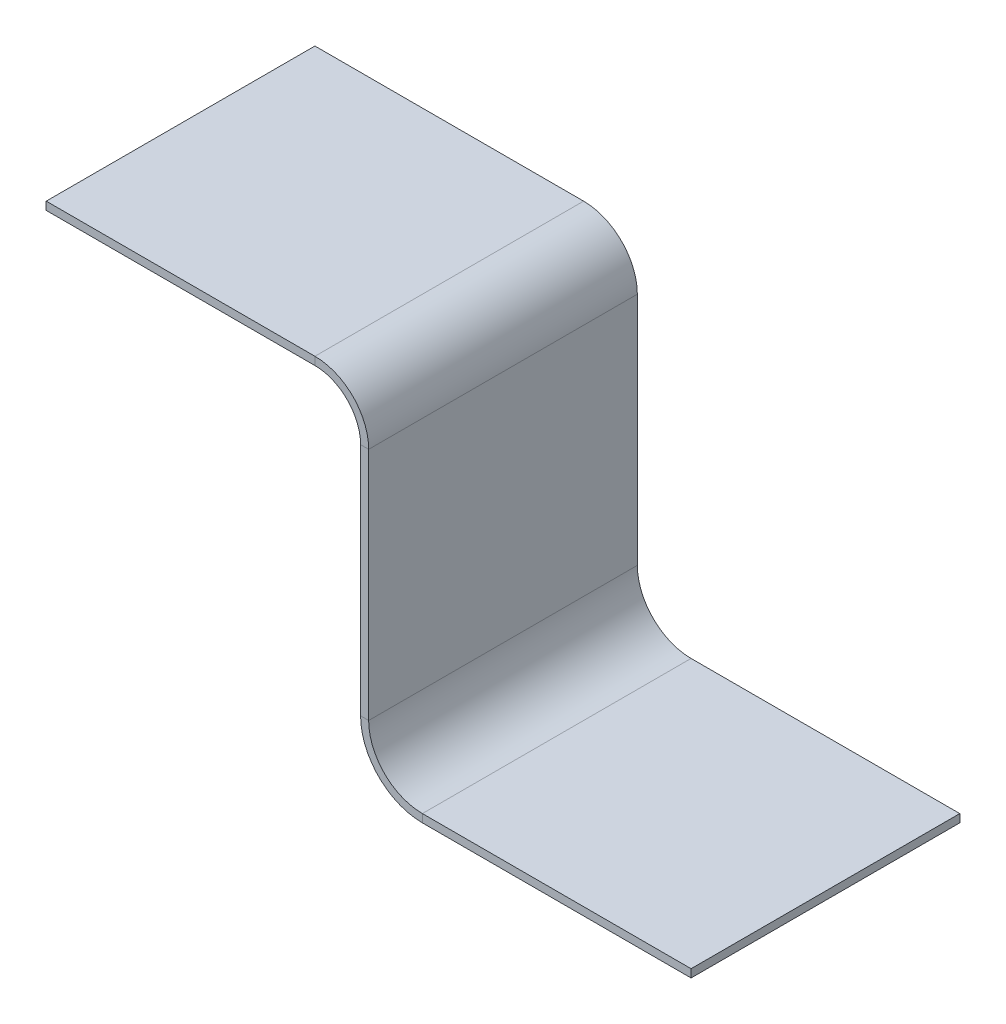
ISO-10303-21;
HEADER;
FILE_DESCRIPTION(('STEP AP214'),'2;1');
FILE_NAME('part.step','',(''),(''),'','','');
FILE_SCHEMA(('AUTOMOTIVE_DESIGN { 1 0 10303 214 1 1 1 1 }'));
ENDSEC;
DATA;
#1=APPLICATION_CONTEXT('core data for automotive mechanical design processes');
#2=APPLICATION_PROTOCOL_DEFINITION('international standard','automotive_design',2000,#1);
#3=PRODUCT_CONTEXT('',#1,'mechanical');
#4=PRODUCT('Part','Part','',(#3));
#5=PRODUCT_RELATED_PRODUCT_CATEGORY('part','',(#4));
#6=PRODUCT_DEFINITION_FORMATION('','',#4);
#7=PRODUCT_DEFINITION_CONTEXT('part definition',#1,'design');
#8=PRODUCT_DEFINITION('design','',#6,#7);
#9=PRODUCT_DEFINITION_SHAPE('','',#8);
#10=(LENGTH_UNIT() NAMED_UNIT(*) SI_UNIT(.MILLI.,.METRE.));
#11=(NAMED_UNIT(*) PLANE_ANGLE_UNIT() SI_UNIT($,.RADIAN.));
#12=(NAMED_UNIT(*) SI_UNIT($,.STERADIAN.) SOLID_ANGLE_UNIT());
#13=UNCERTAINTY_MEASURE_WITH_UNIT(LENGTH_MEASURE(1.E-05),#10,'distance_accuracy_value','');
#14=(GEOMETRIC_REPRESENTATION_CONTEXT(3) GLOBAL_UNCERTAINTY_ASSIGNED_CONTEXT((#13)) GLOBAL_UNIT_ASSIGNED_CONTEXT((#10,
#11,#12)) REPRESENTATION_CONTEXT('',''));
#15=CARTESIAN_POINT('',(0.,0.,0.));
#16=DIRECTION('',(0.,0.,1.));
#17=DIRECTION('',(1.,0.,0.));
#18=AXIS2_PLACEMENT_3D('',#15,#16,#17);
#19=CARTESIAN_POINT('',(0.,5.37,5.));
#20=DIRECTION('',(0.,0.,1.));
#21=DIRECTION('',(1.,0.,0.));
#22=AXIS2_PLACEMENT_3D('',#19,#20,#21);
#23=PLANE('',#22);
#24=DIRECTION('',(-1.,0.,0.));
#25=VECTOR('',#24,1.);
#26=CARTESIAN_POINT('',(0.,5.37,5.));
#27=LINE('',#26,#25);
#28=CARTESIAN_POINT('',(0.,5.37,5.));
#29=VERTEX_POINT('',#28);
#30=CARTESIAN_POINT('',(-0.15,5.37,5.));
#31=VERTEX_POINT('',#30);
#32=EDGE_CURVE('E11',#29,#31,#27,.T.);
#33=ORIENTED_EDGE('',*,*,#32,.F.);
#34=CARTESIAN_POINT('',(-1.,5.37,5.));
#35=DIRECTION('',(0.,0.,-1.));
#36=DIRECTION('',(-1.,0.,0.));
#37=AXIS2_PLACEMENT_3D('',#34,#35,#36);
#38=CIRCLE('',#37,1.);
#39=CARTESIAN_POINT('',(-1.,6.37,5.));
#40=VERTEX_POINT('',#39);
#41=EDGE_CURVE('E247',#40,#29,#38,.T.);
#42=ORIENTED_EDGE('',*,*,#41,.F.);
#43=DIRECTION('',(0.,1.,0.));
#44=VECTOR('',#43,1.);
#45=CARTESIAN_POINT('',(-1.,6.22,5.));
#46=LINE('',#45,#44);
#47=CARTESIAN_POINT('',(-1.,6.22,5.));
#48=VERTEX_POINT('',#47);
#49=EDGE_CURVE('E45',#48,#40,#46,.T.);
#50=ORIENTED_EDGE('',*,*,#49,.F.);
#51=CARTESIAN_POINT('',(-1.,5.37,5.));
#52=DIRECTION('',(0.,0.,1.));
#53=DIRECTION('',(1.,0.,0.));
#54=AXIS2_PLACEMENT_3D('',#51,#52,#53);
#55=CIRCLE('',#54,0.850000000000001);
#56=EDGE_CURVE('E146',#48,#31,#55,.F.);
#57=ORIENTED_EDGE('',*,*,#56,.T.);
#58=EDGE_LOOP('',(#33,#42,#50,#57));
#59=FACE_BOUND('',#58,.T.);
#60=ADVANCED_FACE('F37',(#59),#23,.T.);
#61=CARTESIAN_POINT('',(-1.,6.22,5.));
#62=DIRECTION('',(0.,0.,1.));
#63=DIRECTION('',(1.,0.,0.));
#64=AXIS2_PLACEMENT_3D('',#61,#62,#63);
#65=PLANE('',#64);
#66=DIRECTION('',(0.,-1.,0.));
#67=VECTOR('',#66,1.);
#68=CARTESIAN_POINT('',(0.,5.37,5.));
#69=LINE('',#68,#67);
#70=CARTESIAN_POINT('',(0.,1.00000000000001,5.));
#71=VERTEX_POINT('',#70);
#72=EDGE_CURVE('E140',#29,#71,#69,.T.);
#73=ORIENTED_EDGE('',*,*,#72,.F.);
#74=ORIENTED_EDGE('',*,*,#32,.T.);
#75=DIRECTION('',(0.,-1.,0.));
#76=VECTOR('',#75,1.);
#77=CARTESIAN_POINT('',(-0.15,5.37,5.));
#78=LINE('',#77,#76);
#79=CARTESIAN_POINT('',(-0.149999999999999,1.00000000000001,5.));
#80=VERTEX_POINT('',#79);
#81=EDGE_CURVE('E137',#31,#80,#78,.T.);
#82=ORIENTED_EDGE('',*,*,#81,.T.);
#83=DIRECTION('',(1.,0.,0.));
#84=VECTOR('',#83,1.);
#85=CARTESIAN_POINT('',(-0.149999999999999,1.00000000000001,5.));
#86=LINE('',#85,#84);
#87=EDGE_CURVE('E228',#80,#71,#86,.T.);
#88=ORIENTED_EDGE('',*,*,#87,.T.);
#89=EDGE_LOOP('',(#73,#74,#82,#88));
#90=FACE_BOUND('',#89,.T.);
#91=ADVANCED_FACE('F135',(#90),#65,.T.);
#92=CARTESIAN_POINT('',(-1.,6.37,0.));
#93=DIRECTION('',(0.,0.,-1.));
#94=DIRECTION('',(-1.,0.,0.));
#95=AXIS2_PLACEMENT_3D('',#92,#93,#94);
#96=PLANE('',#95);
#97=DIRECTION('',(0.,-1.,0.));
#98=VECTOR('',#97,1.);
#99=CARTESIAN_POINT('',(-1.,6.37,0.));
#100=LINE('',#99,#98);
#101=CARTESIAN_POINT('',(-1.,6.37,0.));
#102=VERTEX_POINT('',#101);
#103=CARTESIAN_POINT('',(-1.,6.22,0.));
#104=VERTEX_POINT('',#103);
#105=EDGE_CURVE('E233',#102,#104,#100,.T.);
#106=ORIENTED_EDGE('',*,*,#105,.F.);
#107=CARTESIAN_POINT('',(-1.,5.37,0.));
#108=DIRECTION('',(0.,0.,-1.));
#109=DIRECTION('',(-1.,0.,0.));
#110=AXIS2_PLACEMENT_3D('',#107,#108,#109);
#111=CIRCLE('',#110,1.);
#112=CARTESIAN_POINT('',(0.,5.37,0.));
#113=VERTEX_POINT('',#112);
#114=EDGE_CURVE('E185',#102,#113,#111,.T.);
#115=ORIENTED_EDGE('',*,*,#114,.T.);
#116=DIRECTION('',(1.,0.,0.));
#117=VECTOR('',#116,1.);
#118=CARTESIAN_POINT('',(-0.15,5.37,0.));
#119=LINE('',#118,#117);
#120=CARTESIAN_POINT('',(-0.15,5.37,0.));
#121=VERTEX_POINT('',#120);
#122=EDGE_CURVE('E231',#121,#113,#119,.T.);
#123=ORIENTED_EDGE('',*,*,#122,.F.);
#124=CARTESIAN_POINT('',(-1.,5.37,0.));
#125=DIRECTION('',(0.,0.,1.));
#126=DIRECTION('',(1.,0.,0.));
#127=AXIS2_PLACEMENT_3D('',#124,#125,#126);
#128=CIRCLE('',#127,0.850000000000001);
#129=EDGE_CURVE('E158',#104,#121,#128,.F.);
#130=ORIENTED_EDGE('',*,*,#129,.F.);
#131=EDGE_LOOP('',(#106,#115,#123,#130));
#132=FACE_BOUND('',#131,.T.);
#133=ADVANCED_FACE('F285',(#132),#96,.T.);
#134=CARTESIAN_POINT('',(-0.15,5.37,0.));
#135=DIRECTION('',(0.,0.,-1.));
#136=DIRECTION('',(-1.,0.,0.));
#137=AXIS2_PLACEMENT_3D('',#134,#135,#136);
#138=PLANE('',#137);
#139=DIRECTION('',(1.,0.,0.));
#140=VECTOR('',#139,1.);
#141=CARTESIAN_POINT('',(-6.,6.37,0.));
#142=LINE('',#141,#140);
#143=CARTESIAN_POINT('',(-6.,6.37,0.));
#144=VERTEX_POINT('',#143);
#145=EDGE_CURVE('E188',#144,#102,#142,.T.);
#146=ORIENTED_EDGE('',*,*,#145,.T.);
#147=ORIENTED_EDGE('',*,*,#105,.T.);
#148=DIRECTION('',(1.,0.,0.));
#149=VECTOR('',#148,1.);
#150=CARTESIAN_POINT('',(-6.,6.22,0.));
#151=LINE('',#150,#149);
#152=CARTESIAN_POINT('',(-6.,6.22,0.));
#153=VERTEX_POINT('',#152);
#154=EDGE_CURVE('E194',#153,#104,#151,.T.);
#155=ORIENTED_EDGE('',*,*,#154,.F.);
#156=DIRECTION('',(0.,1.,0.));
#157=VECTOR('',#156,1.);
#158=CARTESIAN_POINT('',(-6.,6.22,0.));
#159=LINE('',#158,#157);
#160=EDGE_CURVE('E191',#153,#144,#159,.T.);
#161=ORIENTED_EDGE('',*,*,#160,.T.);
#162=EDGE_LOOP('',(#146,#147,#155,#161));
#163=FACE_BOUND('',#162,.T.);
#164=ADVANCED_FACE('F288',(#163),#138,.T.);
#165=CARTESIAN_POINT('',(1.00000000000001,0.,5.));
#166=DIRECTION('',(0.,0.,1.));
#167=DIRECTION('',(1.,0.,0.));
#168=AXIS2_PLACEMENT_3D('',#165,#166,#167);
#169=PLANE('',#168);
#170=DIRECTION('',(0.,-1.,0.));
#171=VECTOR('',#170,1.);
#172=CARTESIAN_POINT('',(1.00000000000001,0.,5.));
#173=LINE('',#172,#171);
#174=CARTESIAN_POINT('',(1.00000000000001,0.,5.));
#175=VERTEX_POINT('',#174);
#176=CARTESIAN_POINT('',(1.00000000000001,-0.15,5.));
#177=VERTEX_POINT('',#176);
#178=EDGE_CURVE('E53',#175,#177,#173,.T.);
#179=ORIENTED_EDGE('',*,*,#178,.F.);
#180=CARTESIAN_POINT('',(1.,1.,5.));
#181=DIRECTION('',(0.,0.,1.));
#182=DIRECTION('',(1.,0.,0.));
#183=AXIS2_PLACEMENT_3D('',#180,#181,#182);
#184=CIRCLE('',#183,1.);
#185=EDGE_CURVE('E257',#71,#175,#184,.T.);
#186=ORIENTED_EDGE('',*,*,#185,.F.);
#187=ORIENTED_EDGE('',*,*,#87,.F.);
#188=CARTESIAN_POINT('',(1.,1.,5.));
#189=DIRECTION('',(0.,0.,1.));
#190=DIRECTION('',(1.,0.,0.));
#191=AXIS2_PLACEMENT_3D('',#188,#189,#190);
#192=CIRCLE('',#191,1.15);
#193=EDGE_CURVE('E166',#80,#177,#192,.T.);
#194=ORIENTED_EDGE('',*,*,#193,.T.);
#195=EDGE_LOOP('',(#179,#186,#187,#194));
#196=FACE_BOUND('',#195,.T.);
#197=ADVANCED_FACE('F280',(#196),#169,.T.);
#198=CARTESIAN_POINT('',(-0.149999999999999,1.00000000000001,5.));
#199=DIRECTION('',(0.,0.,1.));
#200=DIRECTION('',(1.,0.,0.));
#201=AXIS2_PLACEMENT_3D('',#198,#199,#200);
#202=PLANE('',#201);
#203=DIRECTION('',(1.,0.,0.));
#204=VECTOR('',#203,1.);
#205=CARTESIAN_POINT('',(1.00000000000001,0.,5.));
#206=LINE('',#205,#204);
#207=CARTESIAN_POINT('',(6.,0.,5.));
#208=VERTEX_POINT('',#207);
#209=EDGE_CURVE('E260',#175,#208,#206,.T.);
#210=ORIENTED_EDGE('',*,*,#209,.F.);
#211=ORIENTED_EDGE('',*,*,#178,.T.);
#212=DIRECTION('',(1.,0.,0.));
#213=VECTOR('',#212,1.);
#214=CARTESIAN_POINT('',(1.00000000000001,-0.15,5.));
#215=LINE('',#214,#213);
#216=CARTESIAN_POINT('',(6.,-0.15,5.));
#217=VERTEX_POINT('',#216);
#218=EDGE_CURVE('E107',#177,#217,#215,.T.);
#219=ORIENTED_EDGE('',*,*,#218,.T.);
#220=DIRECTION('',(0.,-1.,0.));
#221=VECTOR('',#220,1.);
#222=CARTESIAN_POINT('',(6.,0.,5.));
#223=LINE('',#222,#221);
#224=EDGE_CURVE('E263',#208,#217,#223,.T.);
#225=ORIENTED_EDGE('',*,*,#224,.F.);
#226=EDGE_LOOP('',(#210,#211,#219,#225));
#227=FACE_BOUND('',#226,.T.);
#228=ADVANCED_FACE('F269',(#227),#202,.T.);
#229=CARTESIAN_POINT('',(0.,1.00000000000001,0.));
#230=DIRECTION('',(0.,0.,-1.));
#231=DIRECTION('',(-1.,0.,0.));
#232=AXIS2_PLACEMENT_3D('',#229,#230,#231);
#233=PLANE('',#232);
#234=DIRECTION('',(-1.,0.,0.));
#235=VECTOR('',#234,1.);
#236=CARTESIAN_POINT('',(0.,1.00000000000001,0.));
#237=LINE('',#236,#235);
#238=CARTESIAN_POINT('',(0.,1.00000000000001,0.));
#239=VERTEX_POINT('',#238);
#240=CARTESIAN_POINT('',(-0.149999999999999,1.00000000000001,0.));
#241=VERTEX_POINT('',#240);
#242=EDGE_CURVE('E94',#239,#241,#237,.T.);
#243=ORIENTED_EDGE('',*,*,#242,.F.);
#244=CARTESIAN_POINT('',(1.,1.,0.));
#245=DIRECTION('',(0.,0.,1.));
#246=DIRECTION('',(1.,0.,0.));
#247=AXIS2_PLACEMENT_3D('',#244,#245,#246);
#248=CIRCLE('',#247,1.);
#249=CARTESIAN_POINT('',(1.00000000000001,0.,0.));
#250=VERTEX_POINT('',#249);
#251=EDGE_CURVE('E181',#239,#250,#248,.T.);
#252=ORIENTED_EDGE('',*,*,#251,.T.);
#253=DIRECTION('',(0.,1.,0.));
#254=VECTOR('',#253,1.);
#255=CARTESIAN_POINT('',(1.00000000000001,-0.15,0.));
#256=LINE('',#255,#254);
#257=CARTESIAN_POINT('',(1.00000000000001,-0.15,0.));
#258=VERTEX_POINT('',#257);
#259=EDGE_CURVE('E101',#258,#250,#256,.T.);
#260=ORIENTED_EDGE('',*,*,#259,.F.);
#261=CARTESIAN_POINT('',(1.,1.,0.));
#262=DIRECTION('',(0.,0.,1.));
#263=DIRECTION('',(1.,0.,0.));
#264=AXIS2_PLACEMENT_3D('',#261,#262,#263);
#265=CIRCLE('',#264,1.15);
#266=EDGE_CURVE('E200',#241,#258,#265,.T.);
#267=ORIENTED_EDGE('',*,*,#266,.F.);
#268=EDGE_LOOP('',(#243,#252,#260,#267));
#269=FACE_BOUND('',#268,.T.);
#270=ADVANCED_FACE('F317',(#269),#233,.T.);
#271=CARTESIAN_POINT('',(1.00000000000001,-0.15,0.));
#272=DIRECTION('',(0.,0.,-1.));
#273=DIRECTION('',(-1.,0.,0.));
#274=AXIS2_PLACEMENT_3D('',#271,#272,#273);
#275=PLANE('',#274);
#276=DIRECTION('',(0.,-1.,0.));
#277=VECTOR('',#276,1.);
#278=CARTESIAN_POINT('',(0.,5.37,0.));
#279=LINE('',#278,#277);
#280=EDGE_CURVE('E183',#113,#239,#279,.T.);
#281=ORIENTED_EDGE('',*,*,#280,.T.);
#282=ORIENTED_EDGE('',*,*,#242,.T.);
#283=DIRECTION('',(0.,-1.,0.));
#284=VECTOR('',#283,1.);
#285=CARTESIAN_POINT('',(-0.15,5.37,0.));
#286=LINE('',#285,#284);
#287=EDGE_CURVE('E198',#121,#241,#286,.T.);
#288=ORIENTED_EDGE('',*,*,#287,.F.);
#289=ORIENTED_EDGE('',*,*,#122,.T.);
#290=EDGE_LOOP('',(#281,#282,#288,#289));
#291=FACE_BOUND('',#290,.T.);
#292=ADVANCED_FACE('F320',(#291),#275,.T.);
#293=CARTESIAN_POINT('',(1.00000000000001,-0.15,5.));
#294=DIRECTION('',(0.,1.,0.));
#295=DIRECTION('',(0.,0.,1.));
#296=AXIS2_PLACEMENT_3D('',#293,#294,#295);
#297=PLANE('',#296);
#298=DIRECTION('',(1.,0.,0.));
#299=VECTOR('',#298,1.);
#300=CARTESIAN_POINT('',(1.00000000000001,-0.15,0.));
#301=LINE('',#300,#299);
#302=CARTESIAN_POINT('',(6.,-0.15,0.));
#303=VERTEX_POINT('',#302);
#304=EDGE_CURVE('E172',#258,#303,#301,.T.);
#305=ORIENTED_EDGE('',*,*,#304,.T.);
#306=DIRECTION('',(0.,0.,-1.));
#307=VECTOR('',#306,1.);
#308=CARTESIAN_POINT('',(6.,-0.15,5.));
#309=LINE('',#308,#307);
#310=EDGE_CURVE('E224',#217,#303,#309,.T.);
#311=ORIENTED_EDGE('',*,*,#310,.F.);
#312=ORIENTED_EDGE('',*,*,#218,.F.);
#313=DIRECTION('',(0.,0.,-1.));
#314=VECTOR('',#313,1.);
#315=CARTESIAN_POINT('',(1.00000000000001,-0.15,5.));
#316=LINE('',#315,#314);
#317=EDGE_CURVE('E168',#177,#258,#316,.T.);
#318=ORIENTED_EDGE('',*,*,#317,.T.);
#319=EDGE_LOOP('',(#305,#311,#312,#318));
#320=FACE_BOUND('',#319,.T.);
#321=ADVANCED_FACE('F323',(#320),#297,.F.);
#322=CARTESIAN_POINT('',(6.,0.,5.));
#323=DIRECTION('',(1.,0.,0.));
#324=DIRECTION('',(0.,0.,-1.));
#325=AXIS2_PLACEMENT_3D('',#322,#323,#324);
#326=PLANE('',#325);
#327=DIRECTION('',(0.,-1.,0.));
#328=VECTOR('',#327,1.);
#329=CARTESIAN_POINT('',(6.,0.,0.));
#330=LINE('',#329,#328);
#331=CARTESIAN_POINT('',(6.,0.,0.));
#332=VERTEX_POINT('',#331);
#333=EDGE_CURVE('E175',#332,#303,#330,.T.);
#334=ORIENTED_EDGE('',*,*,#333,.F.);
#335=DIRECTION('',(0.,0.,-1.));
#336=VECTOR('',#335,1.);
#337=CARTESIAN_POINT('',(6.,0.,5.));
#338=LINE('',#337,#336);
#339=EDGE_CURVE('E222',#208,#332,#338,.T.);
#340=ORIENTED_EDGE('',*,*,#339,.F.);
#341=ORIENTED_EDGE('',*,*,#224,.T.);
#342=ORIENTED_EDGE('',*,*,#310,.T.);
#343=EDGE_LOOP('',(#334,#340,#341,#342));
#344=FACE_BOUND('',#343,.T.);
#345=ADVANCED_FACE('F268',(#344),#326,.T.);
#346=CARTESIAN_POINT('',(1.00000000000001,0.,5.));
#347=DIRECTION('',(0.,1.,0.));
#348=DIRECTION('',(0.,0.,1.));
#349=AXIS2_PLACEMENT_3D('',#346,#347,#348);
#350=PLANE('',#349);
#351=DIRECTION('',(1.,0.,0.));
#352=VECTOR('',#351,1.);
#353=CARTESIAN_POINT('',(1.00000000000001,0.,0.));
#354=LINE('',#353,#352);
#355=EDGE_CURVE('E178',#250,#332,#354,.T.);
#356=ORIENTED_EDGE('',*,*,#355,.F.);
#357=DIRECTION('',(0.,0.,-1.));
#358=VECTOR('',#357,1.);
#359=CARTESIAN_POINT('',(1.00000000000001,0.,5.));
#360=LINE('',#359,#358);
#361=EDGE_CURVE('E219',#175,#250,#360,.T.);
#362=ORIENTED_EDGE('',*,*,#361,.F.);
#363=ORIENTED_EDGE('',*,*,#209,.T.);
#364=ORIENTED_EDGE('',*,*,#339,.T.);
#365=EDGE_LOOP('',(#356,#362,#363,#364));
#366=FACE_BOUND('',#365,.T.);
#367=ADVANCED_FACE('F273',(#366),#350,.T.);
#368=CARTESIAN_POINT('',(1.,1.,5.));
#369=DIRECTION('',(0.,0.,-1.));
#370=DIRECTION('',(-1.,0.,0.));
#371=AXIS2_PLACEMENT_3D('',#368,#369,#370);
#372=CYLINDRICAL_SURFACE('',#371,1.);
#373=ORIENTED_EDGE('',*,*,#251,.F.);
#374=DIRECTION('',(0.,0.,-1.));
#375=VECTOR('',#374,1.);
#376=CARTESIAN_POINT('',(0.,1.00000000000001,5.));
#377=LINE('',#376,#375);
#378=EDGE_CURVE('E216',#71,#239,#377,.T.);
#379=ORIENTED_EDGE('',*,*,#378,.F.);
#380=ORIENTED_EDGE('',*,*,#185,.T.);
#381=ORIENTED_EDGE('',*,*,#361,.T.);
#382=EDGE_LOOP('',(#373,#379,#380,#381));
#383=FACE_BOUND('',#382,.T.);
#384=ADVANCED_FACE('F276',(#383),#372,.F.);
#385=CARTESIAN_POINT('',(0.,5.37,5.));
#386=DIRECTION('',(1.,0.,0.));
#387=DIRECTION('',(0.,1.,0.));
#388=AXIS2_PLACEMENT_3D('',#385,#386,#387);
#389=PLANE('',#388);
#390=ORIENTED_EDGE('',*,*,#280,.F.);
#391=DIRECTION('',(0.,0.,-1.));
#392=VECTOR('',#391,1.);
#393=CARTESIAN_POINT('',(0.,5.37,5.));
#394=LINE('',#393,#392);
#395=EDGE_CURVE('E213',#29,#113,#394,.T.);
#396=ORIENTED_EDGE('',*,*,#395,.F.);
#397=ORIENTED_EDGE('',*,*,#72,.T.);
#398=ORIENTED_EDGE('',*,*,#378,.T.);
#399=EDGE_LOOP('',(#390,#396,#397,#398));
#400=FACE_BOUND('',#399,.T.);
#401=ADVANCED_FACE('F283',(#400),#389,.T.);
#402=CARTESIAN_POINT('',(-1.,5.37,5.));
#403=DIRECTION('',(0.,0.,-1.));
#404=DIRECTION('',(-1.,0.,0.));
#405=AXIS2_PLACEMENT_3D('',#402,#403,#404);
#406=CYLINDRICAL_SURFACE('',#405,1.);
#407=ORIENTED_EDGE('',*,*,#114,.F.);
#408=DIRECTION('',(0.,0.,-1.));
#409=VECTOR('',#408,1.);
#410=CARTESIAN_POINT('',(-1.,6.37,5.));
#411=LINE('',#410,#409);
#412=EDGE_CURVE('E210',#40,#102,#411,.T.);
#413=ORIENTED_EDGE('',*,*,#412,.F.);
#414=ORIENTED_EDGE('',*,*,#41,.T.);
#415=ORIENTED_EDGE('',*,*,#395,.T.);
#416=EDGE_LOOP('',(#407,#413,#414,#415));
#417=FACE_BOUND('',#416,.T.);
#418=ADVANCED_FACE('F246',(#417),#406,.T.);
#419=CARTESIAN_POINT('',(-6.,6.37,5.));
#420=DIRECTION('',(0.,1.,0.));
#421=DIRECTION('',(0.,0.,1.));
#422=AXIS2_PLACEMENT_3D('',#419,#420,#421);
#423=PLANE('',#422);
#424=ORIENTED_EDGE('',*,*,#145,.F.);
#425=DIRECTION('',(0.,0.,-1.));
#426=VECTOR('',#425,1.);
#427=CARTESIAN_POINT('',(-6.,6.37,5.));
#428=LINE('',#427,#426);
#429=CARTESIAN_POINT('',(-6.,6.37,5.));
#430=VERTEX_POINT('',#429);
#431=EDGE_CURVE('E208',#430,#144,#428,.T.);
#432=ORIENTED_EDGE('',*,*,#431,.F.);
#433=DIRECTION('',(1.,0.,0.));
#434=VECTOR('',#433,1.);
#435=CARTESIAN_POINT('',(-6.,6.37,5.));
#436=LINE('',#435,#434);
#437=EDGE_CURVE('E240',#430,#40,#436,.T.);
#438=ORIENTED_EDGE('',*,*,#437,.T.);
#439=ORIENTED_EDGE('',*,*,#412,.T.);
#440=EDGE_LOOP('',(#424,#432,#438,#439));
#441=FACE_BOUND('',#440,.T.);
#442=ADVANCED_FACE('F251',(#441),#423,.T.);
#443=CARTESIAN_POINT('',(-6.,6.22,5.));
#444=DIRECTION('',(-1.,0.,0.));
#445=DIRECTION('',(0.,0.,1.));
#446=AXIS2_PLACEMENT_3D('',#443,#444,#445);
#447=PLANE('',#446);
#448=ORIENTED_EDGE('',*,*,#160,.F.);
#449=DIRECTION('',(0.,0.,-1.));
#450=VECTOR('',#449,1.);
#451=CARTESIAN_POINT('',(-6.,6.22,5.));
#452=LINE('',#451,#450);
#453=CARTESIAN_POINT('',(-6.,6.22,5.));
#454=VERTEX_POINT('',#453);
#455=EDGE_CURVE('E206',#454,#153,#452,.T.);
#456=ORIENTED_EDGE('',*,*,#455,.F.);
#457=DIRECTION('',(0.,1.,0.));
#458=VECTOR('',#457,1.);
#459=CARTESIAN_POINT('',(-6.,6.22,5.));
#460=LINE('',#459,#458);
#461=EDGE_CURVE('E252',#454,#430,#460,.T.);
#462=ORIENTED_EDGE('',*,*,#461,.T.);
#463=ORIENTED_EDGE('',*,*,#431,.T.);
#464=EDGE_LOOP('',(#448,#456,#462,#463));
#465=FACE_BOUND('',#464,.T.);
#466=ADVANCED_FACE('F293',(#465),#447,.T.);
#467=CARTESIAN_POINT('',(-6.,6.22,5.));
#468=DIRECTION('',(0.,1.,0.));
#469=DIRECTION('',(0.,0.,1.));
#470=AXIS2_PLACEMENT_3D('',#467,#468,#469);
#471=PLANE('',#470);
#472=ORIENTED_EDGE('',*,*,#154,.T.);
#473=DIRECTION('',(0.,0.,-1.));
#474=VECTOR('',#473,1.);
#475=CARTESIAN_POINT('',(-1.,6.22,5.));
#476=LINE('',#475,#474);
#477=EDGE_CURVE('E160',#48,#104,#476,.T.);
#478=ORIENTED_EDGE('',*,*,#477,.F.);
#479=DIRECTION('',(1.,0.,0.));
#480=VECTOR('',#479,1.);
#481=CARTESIAN_POINT('',(-6.,6.22,5.));
#482=LINE('',#481,#480);
#483=EDGE_CURVE('E151',#454,#48,#482,.T.);
#484=ORIENTED_EDGE('',*,*,#483,.F.);
#485=ORIENTED_EDGE('',*,*,#455,.T.);
#486=EDGE_LOOP('',(#472,#478,#484,#485));
#487=FACE_BOUND('',#486,.T.);
#488=ADVANCED_FACE('F291',(#487),#471,.F.);
#489=CARTESIAN_POINT('',(-1.,5.37,5.));
#490=DIRECTION('',(0.,0.,-1.));
#491=DIRECTION('',(-1.,0.,0.));
#492=AXIS2_PLACEMENT_3D('',#489,#490,#491);
#493=CYLINDRICAL_SURFACE('',#492,0.850000000000001);
#494=ORIENTED_EDGE('',*,*,#129,.T.);
#495=DIRECTION('',(0.,0.,-1.));
#496=VECTOR('',#495,1.);
#497=CARTESIAN_POINT('',(-0.15,5.37,5.));
#498=LINE('',#497,#496);
#499=EDGE_CURVE('E155',#31,#121,#498,.T.);
#500=ORIENTED_EDGE('',*,*,#499,.F.);
#501=ORIENTED_EDGE('',*,*,#56,.F.);
#502=ORIENTED_EDGE('',*,*,#477,.T.);
#503=EDGE_LOOP('',(#494,#500,#501,#502));
#504=FACE_BOUND('',#503,.T.);
#505=ADVANCED_FACE('F156',(#504),#493,.F.);
#506=CARTESIAN_POINT('',(-0.15,5.37,5.));
#507=DIRECTION('',(1.,0.,0.));
#508=DIRECTION('',(0.,1.,0.));
#509=AXIS2_PLACEMENT_3D('',#506,#507,#508);
#510=PLANE('',#509);
#511=ORIENTED_EDGE('',*,*,#287,.T.);
#512=DIRECTION('',(0.,0.,-1.));
#513=VECTOR('',#512,1.);
#514=CARTESIAN_POINT('',(-0.149999999999999,1.00000000000001,5.));
#515=LINE('',#514,#513);
#516=EDGE_CURVE('E161',#80,#241,#515,.T.);
#517=ORIENTED_EDGE('',*,*,#516,.F.);
#518=ORIENTED_EDGE('',*,*,#81,.F.);
#519=ORIENTED_EDGE('',*,*,#499,.T.);
#520=EDGE_LOOP('',(#511,#517,#518,#519));
#521=FACE_BOUND('',#520,.T.);
#522=ADVANCED_FACE('F163',(#521),#510,.F.);
#523=CARTESIAN_POINT('',(1.,1.,5.));
#524=DIRECTION('',(0.,0.,-1.));
#525=DIRECTION('',(-1.,0.,0.));
#526=AXIS2_PLACEMENT_3D('',#523,#524,#525);
#527=CYLINDRICAL_SURFACE('',#526,1.15);
#528=ORIENTED_EDGE('',*,*,#266,.T.);
#529=ORIENTED_EDGE('',*,*,#317,.F.);
#530=ORIENTED_EDGE('',*,*,#193,.F.);
#531=ORIENTED_EDGE('',*,*,#516,.T.);
#532=EDGE_LOOP('',(#528,#529,#530,#531));
#533=FACE_BOUND('',#532,.T.);
#534=ADVANCED_FACE('F375',(#533),#527,.T.);
#535=CARTESIAN_POINT('',(1.,1.,5.));
#536=DIRECTION('',(0.,0.,1.));
#537=DIRECTION('',(1.,0.,0.));
#538=AXIS2_PLACEMENT_3D('',#535,#536,#537);
#539=PLANE('',#538);
#540=ORIENTED_EDGE('',*,*,#483,.T.);
#541=ORIENTED_EDGE('',*,*,#49,.T.);
#542=ORIENTED_EDGE('',*,*,#437,.F.);
#543=ORIENTED_EDGE('',*,*,#461,.F.);
#544=EDGE_LOOP('',(#540,#541,#542,#543));
#545=FACE_BOUND('',#544,.T.);
#546=ADVANCED_FACE('F237',(#545),#539,.T.);
#547=CARTESIAN_POINT('',(1.,1.,0.));
#548=DIRECTION('',(0.,0.,1.));
#549=DIRECTION('',(1.,0.,0.));
#550=AXIS2_PLACEMENT_3D('',#547,#548,#549);
#551=PLANE('',#550);
#552=ORIENTED_EDGE('',*,*,#304,.F.);
#553=ORIENTED_EDGE('',*,*,#259,.T.);
#554=ORIENTED_EDGE('',*,*,#355,.T.);
#555=ORIENTED_EDGE('',*,*,#333,.T.);
#556=EDGE_LOOP('',(#552,#553,#554,#555));
#557=FACE_BOUND('',#556,.T.);
#558=ADVANCED_FACE('F395',(#557),#551,.F.);
#559=CLOSED_SHELL('',(#60,#91,#133,#164,#197,#228,#270,#292,#321,#345,#367,#384,#401,#418,#442,
#466,#488,#505,#522,#534,#546,#558));
#560=MANIFOLD_SOLID_BREP('B2',#559);
#561=ADVANCED_BREP_SHAPE_REPRESENTATION('',(#18,#560),#14);
#562=SHAPE_DEFINITION_REPRESENTATION(#9,#561);
ENDSEC;
END-ISO-10303-21;
